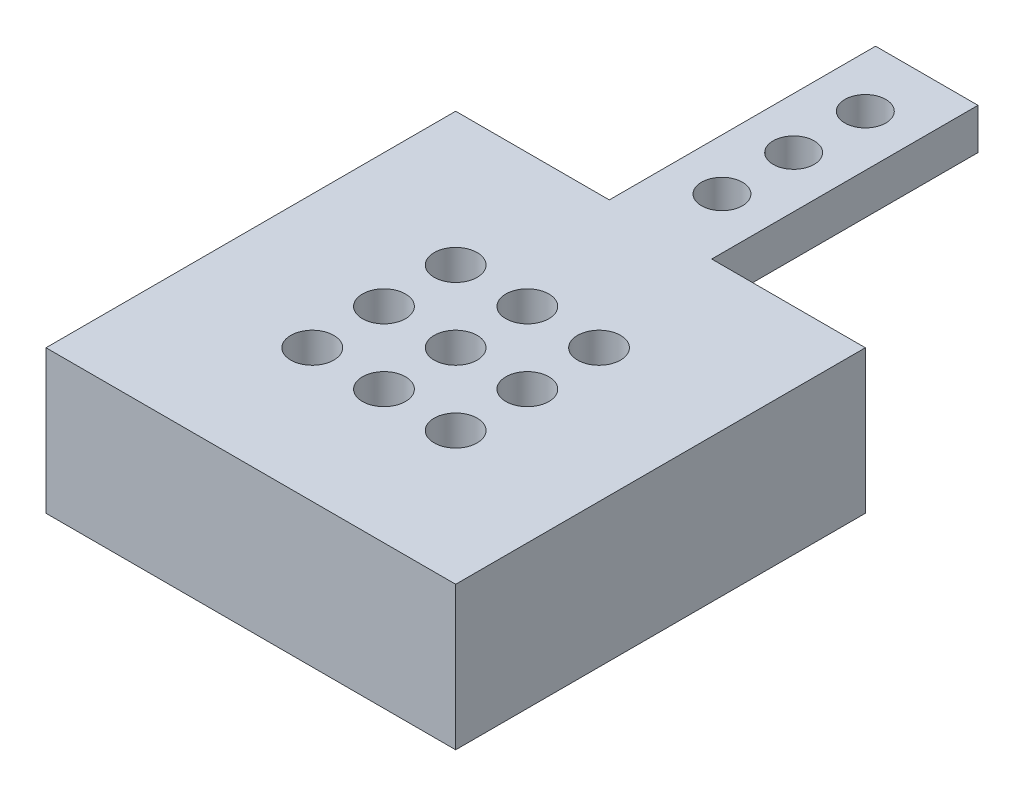
ISO-10303-21;
HEADER;
FILE_DESCRIPTION(('STEP AP214'),'2;1');
FILE_NAME('part.step','',(''),(''),'','','');
FILE_SCHEMA(('AUTOMOTIVE_DESIGN { 1 0 10303 214 1 1 1 1 }'));
ENDSEC;
DATA;
#1=APPLICATION_CONTEXT('core data for automotive mechanical design processes');
#2=APPLICATION_PROTOCOL_DEFINITION('international standard','automotive_design',2000,#1);
#3=PRODUCT_CONTEXT('',#1,'mechanical');
#4=PRODUCT('Part','Part','',(#3));
#5=PRODUCT_RELATED_PRODUCT_CATEGORY('part','',(#4));
#6=PRODUCT_DEFINITION_FORMATION('','',#4);
#7=PRODUCT_DEFINITION_CONTEXT('part definition',#1,'design');
#8=PRODUCT_DEFINITION('design','',#6,#7);
#9=PRODUCT_DEFINITION_SHAPE('','',#8);
#10=(LENGTH_UNIT() NAMED_UNIT(*) SI_UNIT(.MILLI.,.METRE.));
#11=(NAMED_UNIT(*) PLANE_ANGLE_UNIT() SI_UNIT($,.RADIAN.));
#12=(NAMED_UNIT(*) SI_UNIT($,.STERADIAN.) SOLID_ANGLE_UNIT());
#13=UNCERTAINTY_MEASURE_WITH_UNIT(LENGTH_MEASURE(1.E-05),#10,'distance_accuracy_value','');
#14=(GEOMETRIC_REPRESENTATION_CONTEXT(3) GLOBAL_UNCERTAINTY_ASSIGNED_CONTEXT((#13)) GLOBAL_UNIT_ASSIGNED_CONTEXT((#10,
#11,#12)) REPRESENTATION_CONTEXT('',''));
#15=CARTESIAN_POINT('',(0.,0.,0.));
#16=DIRECTION('',(0.,0.,1.));
#17=DIRECTION('',(1.,0.,0.));
#18=AXIS2_PLACEMENT_3D('',#15,#16,#17);
#19=CARTESIAN_POINT('',(0.,14.,-40.));
#20=DIRECTION('',(0.,0.,1.));
#21=DIRECTION('',(1.,0.,0.));
#22=AXIS2_PLACEMENT_3D('',#19,#20,#21);
#23=PLANE('',#22);
#24=DIRECTION('',(0.,1.,0.));
#25=VECTOR('',#24,1.);
#26=CARTESIAN_POINT('',(15.,14.,-40.));
#27=LINE('',#26,#25);
#28=CARTESIAN_POINT('',(15.,10.,-40.));
#29=VERTEX_POINT('',#28);
#30=CARTESIAN_POINT('',(15.,14.,-40.));
#31=VERTEX_POINT('',#30);
#32=EDGE_CURVE('E50',#29,#31,#27,.T.);
#33=ORIENTED_EDGE('',*,*,#32,.F.);
#34=DIRECTION('',(-1.,0.,0.));
#35=VECTOR('',#34,1.);
#36=CARTESIAN_POINT('',(15.,10.,-40.));
#37=LINE('',#36,#35);
#38=CARTESIAN_POINT('',(25.,10.,-40.));
#39=VERTEX_POINT('',#38);
#40=EDGE_CURVE('E119',#39,#29,#37,.T.);
#41=ORIENTED_EDGE('',*,*,#40,.F.);
#42=DIRECTION('',(0.,-1.,0.));
#43=VECTOR('',#42,1.);
#44=CARTESIAN_POINT('',(25.,14.,-40.));
#45=LINE('',#44,#43);
#46=CARTESIAN_POINT('',(25.,14.,-40.));
#47=VERTEX_POINT('',#46);
#48=EDGE_CURVE('E136',#47,#39,#45,.T.);
#49=ORIENTED_EDGE('',*,*,#48,.F.);
#50=DIRECTION('',(-1.,0.,0.));
#51=VECTOR('',#50,1.);
#52=CARTESIAN_POINT('',(0.,14.,-40.));
#53=LINE('',#52,#51);
#54=CARTESIAN_POINT('',(40.,14.,-40.));
#55=VERTEX_POINT('',#54);
#56=EDGE_CURVE('E160',#55,#47,#53,.T.);
#57=ORIENTED_EDGE('',*,*,#56,.F.);
#58=DIRECTION('',(0.,-1.,0.));
#59=VECTOR('',#58,1.);
#60=CARTESIAN_POINT('',(40.,14.,-40.));
#61=LINE('',#60,#59);
#62=CARTESIAN_POINT('',(40.,0.,-40.));
#63=VERTEX_POINT('',#62);
#64=EDGE_CURVE('E165',#55,#63,#61,.T.);
#65=ORIENTED_EDGE('',*,*,#64,.T.);
#66=DIRECTION('',(-1.,0.,0.));
#67=VECTOR('',#66,1.);
#68=CARTESIAN_POINT('',(0.,0.,-40.));
#69=LINE('',#68,#67);
#70=CARTESIAN_POINT('',(0.,0.,-40.));
#71=VERTEX_POINT('',#70);
#72=EDGE_CURVE('E150',#63,#71,#69,.T.);
#73=ORIENTED_EDGE('',*,*,#72,.T.);
#74=DIRECTION('',(0.,-1.,0.));
#75=VECTOR('',#74,1.);
#76=CARTESIAN_POINT('',(0.,14.,-40.));
#77=LINE('',#76,#75);
#78=CARTESIAN_POINT('',(0.,14.,-40.));
#79=VERTEX_POINT('',#78);
#80=EDGE_CURVE('E161',#79,#71,#77,.T.);
#81=ORIENTED_EDGE('',*,*,#80,.F.);
#82=EDGE_CURVE('E55',#31,#79,#53,.T.);
#83=ORIENTED_EDGE('',*,*,#82,.F.);
#84=EDGE_LOOP('',(#33,#41,#49,#57,#65,#73,#81,#83));
#85=FACE_BOUND('',#84,.T.);
#86=ADVANCED_FACE('F33',(#85),#23,.F.);
#87=CARTESIAN_POINT('',(0.,14.,0.));
#88=DIRECTION('',(1.,0.,0.));
#89=DIRECTION('',(0.,0.,-1.));
#90=AXIS2_PLACEMENT_3D('',#87,#88,#89);
#91=PLANE('',#90);
#92=DIRECTION('',(0.,0.,1.));
#93=VECTOR('',#92,1.);
#94=CARTESIAN_POINT('',(0.,0.,0.));
#95=LINE('',#94,#93);
#96=CARTESIAN_POINT('',(0.,0.,0.));
#97=VERTEX_POINT('',#96);
#98=EDGE_CURVE('E122',#71,#97,#95,.T.);
#99=ORIENTED_EDGE('',*,*,#98,.T.);
#100=DIRECTION('',(0.,-1.,0.));
#101=VECTOR('',#100,1.);
#102=CARTESIAN_POINT('',(0.,14.,0.));
#103=LINE('',#102,#101);
#104=CARTESIAN_POINT('',(0.,14.,0.));
#105=VERTEX_POINT('',#104);
#106=EDGE_CURVE('E11',#105,#97,#103,.T.);
#107=ORIENTED_EDGE('',*,*,#106,.F.);
#108=DIRECTION('',(0.,0.,1.));
#109=VECTOR('',#108,1.);
#110=CARTESIAN_POINT('',(0.,14.,0.));
#111=LINE('',#110,#109);
#112=EDGE_CURVE('E147',#79,#105,#111,.T.);
#113=ORIENTED_EDGE('',*,*,#112,.F.);
#114=ORIENTED_EDGE('',*,*,#80,.T.);
#115=EDGE_LOOP('',(#99,#107,#113,#114));
#116=FACE_BOUND('',#115,.T.);
#117=ADVANCED_FACE('F35',(#116),#91,.F.);
#118=CARTESIAN_POINT('',(0.,14.,0.));
#119=DIRECTION('',(0.,0.,-1.));
#120=DIRECTION('',(-1.,0.,0.));
#121=AXIS2_PLACEMENT_3D('',#118,#119,#120);
#122=PLANE('',#121);
#123=DIRECTION('',(1.,0.,0.));
#124=VECTOR('',#123,1.);
#125=CARTESIAN_POINT('',(0.,0.,0.));
#126=LINE('',#125,#124);
#127=CARTESIAN_POINT('',(40.,0.,0.));
#128=VERTEX_POINT('',#127);
#129=EDGE_CURVE('E125',#97,#128,#126,.T.);
#130=ORIENTED_EDGE('',*,*,#129,.T.);
#131=DIRECTION('',(0.,-1.,0.));
#132=VECTOR('',#131,1.);
#133=CARTESIAN_POINT('',(40.,14.,0.));
#134=LINE('',#133,#132);
#135=CARTESIAN_POINT('',(40.,14.,0.));
#136=VERTEX_POINT('',#135);
#137=EDGE_CURVE('E42',#136,#128,#134,.T.);
#138=ORIENTED_EDGE('',*,*,#137,.F.);
#139=DIRECTION('',(1.,0.,0.));
#140=VECTOR('',#139,1.);
#141=CARTESIAN_POINT('',(0.,14.,0.));
#142=LINE('',#141,#140);
#143=EDGE_CURVE('E149',#105,#136,#142,.T.);
#144=ORIENTED_EDGE('',*,*,#143,.F.);
#145=ORIENTED_EDGE('',*,*,#106,.T.);
#146=EDGE_LOOP('',(#130,#138,#144,#145));
#147=FACE_BOUND('',#146,.T.);
#148=ADVANCED_FACE('F174',(#147),#122,.F.);
#149=CARTESIAN_POINT('',(40.,14.,0.));
#150=DIRECTION('',(-1.,0.,0.));
#151=DIRECTION('',(0.,0.,1.));
#152=AXIS2_PLACEMENT_3D('',#149,#150,#151);
#153=PLANE('',#152);
#154=DIRECTION('',(0.,0.,-1.));
#155=VECTOR('',#154,1.);
#156=CARTESIAN_POINT('',(40.,0.,0.));
#157=LINE('',#156,#155);
#158=EDGE_CURVE('E171',#128,#63,#157,.T.);
#159=ORIENTED_EDGE('',*,*,#158,.T.);
#160=ORIENTED_EDGE('',*,*,#64,.F.);
#161=DIRECTION('',(0.,0.,-1.));
#162=VECTOR('',#161,1.);
#163=CARTESIAN_POINT('',(40.,14.,0.));
#164=LINE('',#163,#162);
#165=EDGE_CURVE('E152',#136,#55,#164,.T.);
#166=ORIENTED_EDGE('',*,*,#165,.F.);
#167=ORIENTED_EDGE('',*,*,#137,.T.);
#168=EDGE_LOOP('',(#159,#160,#166,#167));
#169=FACE_BOUND('',#168,.T.);
#170=ADVANCED_FACE('F181',(#169),#153,.F.);
#171=CARTESIAN_POINT('',(0.,14.,0.));
#172=DIRECTION('',(0.,-1.,0.));
#173=DIRECTION('',(0.,0.,-1.));
#174=AXIS2_PLACEMENT_3D('',#171,#172,#173);
#175=PLANE('',#174);
#176=CARTESIAN_POINT('',(13.,14.,-13.));
#177=DIRECTION('',(0.,-1.,0.));
#178=DIRECTION('',(0.,0.,-1.));
#179=AXIS2_PLACEMENT_3D('',#176,#177,#178);
#180=CIRCLE('',#179,2.1);
#181=CARTESIAN_POINT('',(13.,14.,-15.1));
#182=VERTEX_POINT('',#181);
#183=EDGE_CURVE('E255',#182,#182,#180,.T.);
#184=ORIENTED_EDGE('',*,*,#183,.T.);
#185=EDGE_LOOP('',(#184));
#186=FACE_BOUND('',#185,.T.);
#187=CARTESIAN_POINT('',(13.,14.,-20.));
#188=DIRECTION('',(0.,-1.,0.));
#189=DIRECTION('',(0.,0.,-1.));
#190=AXIS2_PLACEMENT_3D('',#187,#188,#189);
#191=CIRCLE('',#190,2.1);
#192=CARTESIAN_POINT('',(13.,14.,-22.1));
#193=VERTEX_POINT('',#192);
#194=EDGE_CURVE('E249',#193,#193,#191,.T.);
#195=ORIENTED_EDGE('',*,*,#194,.T.);
#196=EDGE_LOOP('',(#195));
#197=FACE_BOUND('',#196,.T.);
#198=CARTESIAN_POINT('',(27.,14.,-13.));
#199=DIRECTION('',(0.,-1.,0.));
#200=DIRECTION('',(0.,0.,-1.));
#201=AXIS2_PLACEMENT_3D('',#198,#199,#200);
#202=CIRCLE('',#201,2.1);
#203=CARTESIAN_POINT('',(27.,14.,-15.1));
#204=VERTEX_POINT('',#203);
#205=EDGE_CURVE('E243',#204,#204,#202,.T.);
#206=ORIENTED_EDGE('',*,*,#205,.T.);
#207=EDGE_LOOP('',(#206));
#208=FACE_BOUND('',#207,.T.);
#209=CARTESIAN_POINT('',(20.,14.,-13.));
#210=DIRECTION('',(0.,-1.,0.));
#211=DIRECTION('',(0.,0.,-1.));
#212=AXIS2_PLACEMENT_3D('',#209,#210,#211);
#213=CIRCLE('',#212,2.1);
#214=CARTESIAN_POINT('',(20.,14.,-15.1));
#215=VERTEX_POINT('',#214);
#216=EDGE_CURVE('E237',#215,#215,#213,.T.);
#217=ORIENTED_EDGE('',*,*,#216,.T.);
#218=EDGE_LOOP('',(#217));
#219=FACE_BOUND('',#218,.T.);
#220=CARTESIAN_POINT('',(27.,14.,-20.));
#221=DIRECTION('',(0.,-1.,0.));
#222=DIRECTION('',(0.,0.,-1.));
#223=AXIS2_PLACEMENT_3D('',#220,#221,#222);
#224=CIRCLE('',#223,2.1);
#225=CARTESIAN_POINT('',(27.,14.,-22.1));
#226=VERTEX_POINT('',#225);
#227=EDGE_CURVE('E231',#226,#226,#224,.T.);
#228=ORIENTED_EDGE('',*,*,#227,.T.);
#229=EDGE_LOOP('',(#228));
#230=FACE_BOUND('',#229,.T.);
#231=CARTESIAN_POINT('',(20.,14.,-20.));
#232=DIRECTION('',(0.,-1.,0.));
#233=DIRECTION('',(0.,0.,-1.));
#234=AXIS2_PLACEMENT_3D('',#231,#232,#233);
#235=CIRCLE('',#234,2.1);
#236=CARTESIAN_POINT('',(20.,14.,-22.1));
#237=VERTEX_POINT('',#236);
#238=EDGE_CURVE('E225',#237,#237,#235,.T.);
#239=ORIENTED_EDGE('',*,*,#238,.T.);
#240=EDGE_LOOP('',(#239));
#241=FACE_BOUND('',#240,.T.);
#242=CARTESIAN_POINT('',(27.,14.,-27.));
#243=DIRECTION('',(0.,-1.,0.));
#244=DIRECTION('',(0.,0.,-1.));
#245=AXIS2_PLACEMENT_3D('',#242,#243,#244);
#246=CIRCLE('',#245,2.1);
#247=CARTESIAN_POINT('',(27.,14.,-29.1));
#248=VERTEX_POINT('',#247);
#249=EDGE_CURVE('E219',#248,#248,#246,.T.);
#250=ORIENTED_EDGE('',*,*,#249,.T.);
#251=EDGE_LOOP('',(#250));
#252=FACE_BOUND('',#251,.T.);
#253=CARTESIAN_POINT('',(20.,14.,-27.));
#254=DIRECTION('',(0.,-1.,0.));
#255=DIRECTION('',(0.,0.,-1.));
#256=AXIS2_PLACEMENT_3D('',#253,#254,#255);
#257=CIRCLE('',#256,2.1);
#258=CARTESIAN_POINT('',(20.,14.,-29.1));
#259=VERTEX_POINT('',#258);
#260=EDGE_CURVE('E213',#259,#259,#257,.T.);
#261=ORIENTED_EDGE('',*,*,#260,.T.);
#262=EDGE_LOOP('',(#261));
#263=FACE_BOUND('',#262,.T.);
#264=CARTESIAN_POINT('',(13.,14.,-27.));
#265=DIRECTION('',(0.,-1.,0.));
#266=DIRECTION('',(0.,0.,-1.));
#267=AXIS2_PLACEMENT_3D('',#264,#265,#266);
#268=CIRCLE('',#267,2.1);
#269=CARTESIAN_POINT('',(13.,14.,-29.1));
#270=VERTEX_POINT('',#269);
#271=EDGE_CURVE('E207',#270,#270,#268,.T.);
#272=ORIENTED_EDGE('',*,*,#271,.T.);
#273=EDGE_LOOP('',(#272));
#274=FACE_BOUND('',#273,.T.);
#275=CARTESIAN_POINT('',(20.,14.,-46.));
#276=DIRECTION('',(0.,1.,0.));
#277=DIRECTION('',(0.,0.,1.));
#278=AXIS2_PLACEMENT_3D('',#275,#276,#277);
#279=CIRCLE('',#278,2.);
#280=CARTESIAN_POINT('',(20.,14.,-44.));
#281=VERTEX_POINT('',#280);
#282=EDGE_CURVE('E204',#281,#281,#279,.T.);
#283=ORIENTED_EDGE('',*,*,#282,.F.);
#284=EDGE_LOOP('',(#283));
#285=FACE_BOUND('',#284,.T.);
#286=CARTESIAN_POINT('',(20.,14.,-53.));
#287=DIRECTION('',(0.,1.,0.));
#288=DIRECTION('',(0.,0.,1.));
#289=AXIS2_PLACEMENT_3D('',#286,#287,#288);
#290=CIRCLE('',#289,2.);
#291=CARTESIAN_POINT('',(20.,14.,-51.));
#292=VERTEX_POINT('',#291);
#293=EDGE_CURVE('E201',#292,#292,#290,.T.);
#294=ORIENTED_EDGE('',*,*,#293,.F.);
#295=EDGE_LOOP('',(#294));
#296=FACE_BOUND('',#295,.T.);
#297=CARTESIAN_POINT('',(20.,14.,-60.));
#298=DIRECTION('',(0.,1.,0.));
#299=DIRECTION('',(0.,0.,1.));
#300=AXIS2_PLACEMENT_3D('',#297,#298,#299);
#301=CIRCLE('',#300,2.);
#302=CARTESIAN_POINT('',(20.,14.,-58.));
#303=VERTEX_POINT('',#302);
#304=EDGE_CURVE('E197',#303,#303,#301,.T.);
#305=ORIENTED_EDGE('',*,*,#304,.F.);
#306=EDGE_LOOP('',(#305));
#307=FACE_BOUND('',#306,.T.);
#308=ORIENTED_EDGE('',*,*,#112,.T.);
#309=ORIENTED_EDGE('',*,*,#143,.T.);
#310=ORIENTED_EDGE('',*,*,#165,.T.);
#311=ORIENTED_EDGE('',*,*,#56,.T.);
#312=DIRECTION('',(0.,0.,1.));
#313=VECTOR('',#312,1.);
#314=CARTESIAN_POINT('',(25.,14.,-66.));
#315=LINE('',#314,#313);
#316=CARTESIAN_POINT('',(25.,14.,-66.));
#317=VERTEX_POINT('',#316);
#318=EDGE_CURVE('E106',#317,#47,#315,.T.);
#319=ORIENTED_EDGE('',*,*,#318,.F.);
#320=DIRECTION('',(1.,0.,0.));
#321=VECTOR('',#320,1.);
#322=CARTESIAN_POINT('',(15.,14.,-66.));
#323=LINE('',#322,#321);
#324=CARTESIAN_POINT('',(15.,14.,-66.));
#325=VERTEX_POINT('',#324);
#326=EDGE_CURVE('E98',#325,#317,#323,.T.);
#327=ORIENTED_EDGE('',*,*,#326,.F.);
#328=DIRECTION('',(0.,0.,1.));
#329=VECTOR('',#328,1.);
#330=CARTESIAN_POINT('',(15.,14.,-66.));
#331=LINE('',#330,#329);
#332=EDGE_CURVE('E103',#325,#31,#331,.T.);
#333=ORIENTED_EDGE('',*,*,#332,.T.);
#334=ORIENTED_EDGE('',*,*,#82,.T.);
#335=EDGE_LOOP('',(#308,#309,#310,#311,#319,#327,#333,#334));
#336=FACE_BOUND('',#335,.T.);
#337=ADVANCED_FACE('F101',(#186,#197,#208,#219,#230,#241,#252,#263,#274,#285,#296,#307,#336),
#175,.F.);
#338=CARTESIAN_POINT('',(0.,0.,0.));
#339=DIRECTION('',(0.,-1.,0.));
#340=DIRECTION('',(0.,0.,-1.));
#341=AXIS2_PLACEMENT_3D('',#338,#339,#340);
#342=PLANE('',#341);
#343=CARTESIAN_POINT('',(13.,0.,-13.));
#344=DIRECTION('',(0.,-1.,0.));
#345=DIRECTION('',(0.,0.,-1.));
#346=AXIS2_PLACEMENT_3D('',#343,#344,#345);
#347=CIRCLE('',#346,2.1);
#348=CARTESIAN_POINT('',(13.,0.,-15.1));
#349=VERTEX_POINT('',#348);
#350=EDGE_CURVE('E258',#349,#349,#347,.T.);
#351=ORIENTED_EDGE('',*,*,#350,.F.);
#352=EDGE_LOOP('',(#351));
#353=FACE_BOUND('',#352,.T.);
#354=CARTESIAN_POINT('',(13.,0.,-20.));
#355=DIRECTION('',(0.,-1.,0.));
#356=DIRECTION('',(0.,0.,-1.));
#357=AXIS2_PLACEMENT_3D('',#354,#355,#356);
#358=CIRCLE('',#357,2.1);
#359=CARTESIAN_POINT('',(13.,0.,-22.1));
#360=VERTEX_POINT('',#359);
#361=EDGE_CURVE('E252',#360,#360,#358,.T.);
#362=ORIENTED_EDGE('',*,*,#361,.F.);
#363=EDGE_LOOP('',(#362));
#364=FACE_BOUND('',#363,.T.);
#365=CARTESIAN_POINT('',(27.,0.,-13.));
#366=DIRECTION('',(0.,-1.,0.));
#367=DIRECTION('',(0.,0.,-1.));
#368=AXIS2_PLACEMENT_3D('',#365,#366,#367);
#369=CIRCLE('',#368,2.1);
#370=CARTESIAN_POINT('',(27.,0.,-15.1));
#371=VERTEX_POINT('',#370);
#372=EDGE_CURVE('E246',#371,#371,#369,.T.);
#373=ORIENTED_EDGE('',*,*,#372,.F.);
#374=EDGE_LOOP('',(#373));
#375=FACE_BOUND('',#374,.T.);
#376=CARTESIAN_POINT('',(20.,0.,-13.));
#377=DIRECTION('',(0.,-1.,0.));
#378=DIRECTION('',(0.,0.,-1.));
#379=AXIS2_PLACEMENT_3D('',#376,#377,#378);
#380=CIRCLE('',#379,2.1);
#381=CARTESIAN_POINT('',(20.,0.,-15.1));
#382=VERTEX_POINT('',#381);
#383=EDGE_CURVE('E240',#382,#382,#380,.T.);
#384=ORIENTED_EDGE('',*,*,#383,.F.);
#385=EDGE_LOOP('',(#384));
#386=FACE_BOUND('',#385,.T.);
#387=CARTESIAN_POINT('',(27.,0.,-20.));
#388=DIRECTION('',(0.,-1.,0.));
#389=DIRECTION('',(0.,0.,-1.));
#390=AXIS2_PLACEMENT_3D('',#387,#388,#389);
#391=CIRCLE('',#390,2.1);
#392=CARTESIAN_POINT('',(27.,0.,-22.1));
#393=VERTEX_POINT('',#392);
#394=EDGE_CURVE('E234',#393,#393,#391,.T.);
#395=ORIENTED_EDGE('',*,*,#394,.F.);
#396=EDGE_LOOP('',(#395));
#397=FACE_BOUND('',#396,.T.);
#398=CARTESIAN_POINT('',(20.,0.,-20.));
#399=DIRECTION('',(0.,-1.,0.));
#400=DIRECTION('',(0.,0.,-1.));
#401=AXIS2_PLACEMENT_3D('',#398,#399,#400);
#402=CIRCLE('',#401,2.1);
#403=CARTESIAN_POINT('',(20.,0.,-22.1));
#404=VERTEX_POINT('',#403);
#405=EDGE_CURVE('E228',#404,#404,#402,.T.);
#406=ORIENTED_EDGE('',*,*,#405,.F.);
#407=EDGE_LOOP('',(#406));
#408=FACE_BOUND('',#407,.T.);
#409=CARTESIAN_POINT('',(27.,0.,-27.));
#410=DIRECTION('',(0.,-1.,0.));
#411=DIRECTION('',(0.,0.,-1.));
#412=AXIS2_PLACEMENT_3D('',#409,#410,#411);
#413=CIRCLE('',#412,2.1);
#414=CARTESIAN_POINT('',(27.,0.,-29.1));
#415=VERTEX_POINT('',#414);
#416=EDGE_CURVE('E222',#415,#415,#413,.T.);
#417=ORIENTED_EDGE('',*,*,#416,.F.);
#418=EDGE_LOOP('',(#417));
#419=FACE_BOUND('',#418,.T.);
#420=CARTESIAN_POINT('',(20.,0.,-27.));
#421=DIRECTION('',(0.,-1.,0.));
#422=DIRECTION('',(0.,0.,-1.));
#423=AXIS2_PLACEMENT_3D('',#420,#421,#422);
#424=CIRCLE('',#423,2.1);
#425=CARTESIAN_POINT('',(20.,0.,-29.1));
#426=VERTEX_POINT('',#425);
#427=EDGE_CURVE('E216',#426,#426,#424,.T.);
#428=ORIENTED_EDGE('',*,*,#427,.F.);
#429=EDGE_LOOP('',(#428));
#430=FACE_BOUND('',#429,.T.);
#431=CARTESIAN_POINT('',(13.,0.,-27.));
#432=DIRECTION('',(0.,-1.,0.));
#433=DIRECTION('',(0.,0.,-1.));
#434=AXIS2_PLACEMENT_3D('',#431,#432,#433);
#435=CIRCLE('',#434,2.1);
#436=CARTESIAN_POINT('',(13.,0.,-29.1));
#437=VERTEX_POINT('',#436);
#438=EDGE_CURVE('E210',#437,#437,#435,.T.);
#439=ORIENTED_EDGE('',*,*,#438,.F.);
#440=EDGE_LOOP('',(#439));
#441=FACE_BOUND('',#440,.T.);
#442=ORIENTED_EDGE('',*,*,#98,.F.);
#443=ORIENTED_EDGE('',*,*,#72,.F.);
#444=ORIENTED_EDGE('',*,*,#158,.F.);
#445=ORIENTED_EDGE('',*,*,#129,.F.);
#446=EDGE_LOOP('',(#442,#443,#444,#445));
#447=FACE_BOUND('',#446,.T.);
#448=ADVANCED_FACE('F184',(#353,#364,#375,#386,#397,#408,#419,#430,#441,#447),#342,.T.);
#449=CARTESIAN_POINT('',(15.,14.,-66.));
#450=DIRECTION('',(1.,0.,0.));
#451=DIRECTION('',(0.,1.,0.));
#452=AXIS2_PLACEMENT_3D('',#449,#450,#451);
#453=PLANE('',#452);
#454=ORIENTED_EDGE('',*,*,#32,.T.);
#455=ORIENTED_EDGE('',*,*,#332,.F.);
#456=DIRECTION('',(0.,1.,0.));
#457=VECTOR('',#456,1.);
#458=CARTESIAN_POINT('',(15.,14.,-66.));
#459=LINE('',#458,#457);
#460=CARTESIAN_POINT('',(15.,10.,-66.));
#461=VERTEX_POINT('',#460);
#462=EDGE_CURVE('E110',#461,#325,#459,.T.);
#463=ORIENTED_EDGE('',*,*,#462,.F.);
#464=DIRECTION('',(0.,0.,1.));
#465=VECTOR('',#464,1.);
#466=CARTESIAN_POINT('',(15.,10.,-66.));
#467=LINE('',#466,#465);
#468=EDGE_CURVE('E143',#461,#29,#467,.T.);
#469=ORIENTED_EDGE('',*,*,#468,.T.);
#470=EDGE_LOOP('',(#454,#455,#463,#469));
#471=FACE_BOUND('',#470,.T.);
#472=ADVANCED_FACE('F121',(#471),#453,.F.);
#473=CARTESIAN_POINT('',(25.,14.,-66.));
#474=DIRECTION('',(-1.,0.,0.));
#475=DIRECTION('',(0.,0.,1.));
#476=AXIS2_PLACEMENT_3D('',#473,#474,#475);
#477=PLANE('',#476);
#478=ORIENTED_EDGE('',*,*,#48,.T.);
#479=DIRECTION('',(0.,0.,1.));
#480=VECTOR('',#479,1.);
#481=CARTESIAN_POINT('',(25.,10.,-66.));
#482=LINE('',#481,#480);
#483=CARTESIAN_POINT('',(25.,10.,-66.));
#484=VERTEX_POINT('',#483);
#485=EDGE_CURVE('E127',#484,#39,#482,.T.);
#486=ORIENTED_EDGE('',*,*,#485,.F.);
#487=DIRECTION('',(0.,-1.,0.));
#488=VECTOR('',#487,1.);
#489=CARTESIAN_POINT('',(25.,14.,-66.));
#490=LINE('',#489,#488);
#491=EDGE_CURVE('E109',#317,#484,#490,.T.);
#492=ORIENTED_EDGE('',*,*,#491,.F.);
#493=ORIENTED_EDGE('',*,*,#318,.T.);
#494=EDGE_LOOP('',(#478,#486,#492,#493));
#495=FACE_BOUND('',#494,.T.);
#496=ADVANCED_FACE('F193',(#495),#477,.F.);
#497=CARTESIAN_POINT('',(15.,10.,-66.));
#498=DIRECTION('',(0.,1.,0.));
#499=DIRECTION('',(0.,0.,1.));
#500=AXIS2_PLACEMENT_3D('',#497,#498,#499);
#501=PLANE('',#500);
#502=CARTESIAN_POINT('',(20.,10.,-46.));
#503=DIRECTION('',(0.,1.,0.));
#504=DIRECTION('',(0.,0.,1.));
#505=AXIS2_PLACEMENT_3D('',#502,#503,#504);
#506=CIRCLE('',#505,2.);
#507=CARTESIAN_POINT('',(20.,10.,-44.));
#508=VERTEX_POINT('',#507);
#509=EDGE_CURVE('E37',#508,#508,#506,.T.);
#510=ORIENTED_EDGE('',*,*,#509,.T.);
#511=EDGE_LOOP('',(#510));
#512=FACE_BOUND('',#511,.T.);
#513=CARTESIAN_POINT('',(20.,10.,-53.));
#514=DIRECTION('',(0.,1.,0.));
#515=DIRECTION('',(0.,0.,1.));
#516=AXIS2_PLACEMENT_3D('',#513,#514,#515);
#517=CIRCLE('',#516,2.);
#518=CARTESIAN_POINT('',(20.,10.,-51.));
#519=VERTEX_POINT('',#518);
#520=EDGE_CURVE('E200',#519,#519,#517,.T.);
#521=ORIENTED_EDGE('',*,*,#520,.T.);
#522=EDGE_LOOP('',(#521));
#523=FACE_BOUND('',#522,.T.);
#524=CARTESIAN_POINT('',(20.,10.,-60.));
#525=DIRECTION('',(0.,1.,0.));
#526=DIRECTION('',(0.,0.,1.));
#527=AXIS2_PLACEMENT_3D('',#524,#525,#526);
#528=CIRCLE('',#527,2.);
#529=CARTESIAN_POINT('',(20.,10.,-58.));
#530=VERTEX_POINT('',#529);
#531=EDGE_CURVE('E137',#530,#530,#528,.T.);
#532=ORIENTED_EDGE('',*,*,#531,.T.);
#533=EDGE_LOOP('',(#532));
#534=FACE_BOUND('',#533,.T.);
#535=ORIENTED_EDGE('',*,*,#40,.T.);
#536=ORIENTED_EDGE('',*,*,#468,.F.);
#537=DIRECTION('',(-1.,0.,0.));
#538=VECTOR('',#537,1.);
#539=CARTESIAN_POINT('',(15.,10.,-66.));
#540=LINE('',#539,#538);
#541=EDGE_CURVE('E115',#484,#461,#540,.T.);
#542=ORIENTED_EDGE('',*,*,#541,.F.);
#543=ORIENTED_EDGE('',*,*,#485,.T.);
#544=EDGE_LOOP('',(#535,#536,#542,#543));
#545=FACE_BOUND('',#544,.T.);
#546=ADVANCED_FACE('F195',(#512,#523,#534,#545),#501,.F.);
#547=CARTESIAN_POINT('',(0.,0.,-66.));
#548=DIRECTION('',(0.,0.,1.));
#549=DIRECTION('',(1.,0.,0.));
#550=AXIS2_PLACEMENT_3D('',#547,#548,#549);
#551=PLANE('',#550);
#552=ORIENTED_EDGE('',*,*,#462,.T.);
#553=ORIENTED_EDGE('',*,*,#326,.T.);
#554=ORIENTED_EDGE('',*,*,#491,.T.);
#555=ORIENTED_EDGE('',*,*,#541,.T.);
#556=EDGE_LOOP('',(#552,#553,#554,#555));
#557=FACE_BOUND('',#556,.T.);
#558=ADVANCED_FACE('F113',(#557),#551,.F.);
#559=CARTESIAN_POINT('',(20.,-12.,-60.));
#560=DIRECTION('',(0.,1.,0.));
#561=DIRECTION('',(0.,0.,1.));
#562=AXIS2_PLACEMENT_3D('',#559,#560,#561);
#563=CYLINDRICAL_SURFACE('',#562,2.);
#564=ORIENTED_EDGE('',*,*,#304,.T.);
#565=EDGE_LOOP('',(#564));
#566=FACE_BOUND('',#565,.T.);
#567=ORIENTED_EDGE('',*,*,#531,.F.);
#568=EDGE_LOOP('',(#567));
#569=FACE_BOUND('',#568,.T.);
#570=ADVANCED_FACE('F302',(#566,#569),#563,.F.);
#571=CARTESIAN_POINT('',(20.,-12.,-53.));
#572=DIRECTION('',(0.,1.,0.));
#573=DIRECTION('',(0.,0.,1.));
#574=AXIS2_PLACEMENT_3D('',#571,#572,#573);
#575=CYLINDRICAL_SURFACE('',#574,2.);
#576=ORIENTED_EDGE('',*,*,#293,.T.);
#577=EDGE_LOOP('',(#576));
#578=FACE_BOUND('',#577,.T.);
#579=ORIENTED_EDGE('',*,*,#520,.F.);
#580=EDGE_LOOP('',(#579));
#581=FACE_BOUND('',#580,.T.);
#582=ADVANCED_FACE('F305',(#578,#581),#575,.F.);
#583=CARTESIAN_POINT('',(20.,-12.,-46.));
#584=DIRECTION('',(0.,1.,0.));
#585=DIRECTION('',(0.,0.,1.));
#586=AXIS2_PLACEMENT_3D('',#583,#584,#585);
#587=CYLINDRICAL_SURFACE('',#586,2.);
#588=ORIENTED_EDGE('',*,*,#282,.T.);
#589=EDGE_LOOP('',(#588));
#590=FACE_BOUND('',#589,.T.);
#591=ORIENTED_EDGE('',*,*,#509,.F.);
#592=EDGE_LOOP('',(#591));
#593=FACE_BOUND('',#592,.T.);
#594=ADVANCED_FACE('F288',(#590,#593),#587,.F.);
#595=CARTESIAN_POINT('',(13.,14.00005,-27.));
#596=DIRECTION('',(0.,-1.,0.));
#597=DIRECTION('',(0.,0.,-1.));
#598=AXIS2_PLACEMENT_3D('',#595,#596,#597);
#599=CYLINDRICAL_SURFACE('',#598,2.1);
#600=ORIENTED_EDGE('',*,*,#438,.T.);
#601=EDGE_LOOP('',(#600));
#602=FACE_BOUND('',#601,.T.);
#603=ORIENTED_EDGE('',*,*,#271,.F.);
#604=EDGE_LOOP('',(#603));
#605=FACE_BOUND('',#604,.T.);
#606=ADVANCED_FACE('F284',(#602,#605),#599,.F.);
#607=CARTESIAN_POINT('',(20.,14.00005,-27.));
#608=DIRECTION('',(0.,-1.,0.));
#609=DIRECTION('',(0.,0.,-1.));
#610=AXIS2_PLACEMENT_3D('',#607,#608,#609);
#611=CYLINDRICAL_SURFACE('',#610,2.1);
#612=ORIENTED_EDGE('',*,*,#427,.T.);
#613=EDGE_LOOP('',(#612));
#614=FACE_BOUND('',#613,.T.);
#615=ORIENTED_EDGE('',*,*,#260,.F.);
#616=EDGE_LOOP('',(#615));
#617=FACE_BOUND('',#616,.T.);
#618=ADVANCED_FACE('F287',(#614,#617),#611,.F.);
#619=CARTESIAN_POINT('',(27.,14.00005,-27.));
#620=DIRECTION('',(0.,-1.,0.));
#621=DIRECTION('',(0.,0.,-1.));
#622=AXIS2_PLACEMENT_3D('',#619,#620,#621);
#623=CYLINDRICAL_SURFACE('',#622,2.1);
#624=ORIENTED_EDGE('',*,*,#416,.T.);
#625=EDGE_LOOP('',(#624));
#626=FACE_BOUND('',#625,.T.);
#627=ORIENTED_EDGE('',*,*,#249,.F.);
#628=EDGE_LOOP('',(#627));
#629=FACE_BOUND('',#628,.T.);
#630=ADVANCED_FACE('F407',(#626,#629),#623,.F.);
#631=CARTESIAN_POINT('',(20.,14.00005,-20.));
#632=DIRECTION('',(0.,-1.,0.));
#633=DIRECTION('',(0.,0.,-1.));
#634=AXIS2_PLACEMENT_3D('',#631,#632,#633);
#635=CYLINDRICAL_SURFACE('',#634,2.1);
#636=ORIENTED_EDGE('',*,*,#405,.T.);
#637=EDGE_LOOP('',(#636));
#638=FACE_BOUND('',#637,.T.);
#639=ORIENTED_EDGE('',*,*,#238,.F.);
#640=EDGE_LOOP('',(#639));
#641=FACE_BOUND('',#640,.T.);
#642=ADVANCED_FACE('F415',(#638,#641),#635,.F.);
#643=CARTESIAN_POINT('',(27.,14.00005,-20.));
#644=DIRECTION('',(0.,-1.,0.));
#645=DIRECTION('',(0.,0.,-1.));
#646=AXIS2_PLACEMENT_3D('',#643,#644,#645);
#647=CYLINDRICAL_SURFACE('',#646,2.1);
#648=ORIENTED_EDGE('',*,*,#394,.T.);
#649=EDGE_LOOP('',(#648));
#650=FACE_BOUND('',#649,.T.);
#651=ORIENTED_EDGE('',*,*,#227,.F.);
#652=EDGE_LOOP('',(#651));
#653=FACE_BOUND('',#652,.T.);
#654=ADVANCED_FACE('F423',(#650,#653),#647,.F.);
#655=CARTESIAN_POINT('',(20.,14.00005,-13.));
#656=DIRECTION('',(0.,-1.,0.));
#657=DIRECTION('',(0.,0.,-1.));
#658=AXIS2_PLACEMENT_3D('',#655,#656,#657);
#659=CYLINDRICAL_SURFACE('',#658,2.1);
#660=ORIENTED_EDGE('',*,*,#383,.T.);
#661=EDGE_LOOP('',(#660));
#662=FACE_BOUND('',#661,.T.);
#663=ORIENTED_EDGE('',*,*,#216,.F.);
#664=EDGE_LOOP('',(#663));
#665=FACE_BOUND('',#664,.T.);
#666=ADVANCED_FACE('F431',(#662,#665),#659,.F.);
#667=CARTESIAN_POINT('',(27.,14.00005,-13.));
#668=DIRECTION('',(0.,-1.,0.));
#669=DIRECTION('',(0.,0.,-1.));
#670=AXIS2_PLACEMENT_3D('',#667,#668,#669);
#671=CYLINDRICAL_SURFACE('',#670,2.1);
#672=ORIENTED_EDGE('',*,*,#372,.T.);
#673=EDGE_LOOP('',(#672));
#674=FACE_BOUND('',#673,.T.);
#675=ORIENTED_EDGE('',*,*,#205,.F.);
#676=EDGE_LOOP('',(#675));
#677=FACE_BOUND('',#676,.T.);
#678=ADVANCED_FACE('F439',(#674,#677),#671,.F.);
#679=CARTESIAN_POINT('',(13.,14.00005,-20.));
#680=DIRECTION('',(0.,-1.,0.));
#681=DIRECTION('',(0.,0.,-1.));
#682=AXIS2_PLACEMENT_3D('',#679,#680,#681);
#683=CYLINDRICAL_SURFACE('',#682,2.1);
#684=ORIENTED_EDGE('',*,*,#361,.T.);
#685=EDGE_LOOP('',(#684));
#686=FACE_BOUND('',#685,.T.);
#687=ORIENTED_EDGE('',*,*,#194,.F.);
#688=EDGE_LOOP('',(#687));
#689=FACE_BOUND('',#688,.T.);
#690=ADVANCED_FACE('F447',(#686,#689),#683,.F.);
#691=CARTESIAN_POINT('',(13.,14.00005,-13.));
#692=DIRECTION('',(0.,-1.,0.));
#693=DIRECTION('',(0.,0.,-1.));
#694=AXIS2_PLACEMENT_3D('',#691,#692,#693);
#695=CYLINDRICAL_SURFACE('',#694,2.1);
#696=ORIENTED_EDGE('',*,*,#350,.T.);
#697=EDGE_LOOP('',(#696));
#698=FACE_BOUND('',#697,.T.);
#699=ORIENTED_EDGE('',*,*,#183,.F.);
#700=EDGE_LOOP('',(#699));
#701=FACE_BOUND('',#700,.T.);
#702=ADVANCED_FACE('F262',(#698,#701),#695,.F.);
#703=CLOSED_SHELL('',(#86,#117,#148,#170,#337,#448,#472,#496,#546,#558,#570,#582,#594,#606,#618,
#630,#642,#654,#666,#678,#690,#702));
#704=MANIFOLD_SOLID_BREP('B2',#703);
#705=ADVANCED_BREP_SHAPE_REPRESENTATION('',(#18,#704),#14);
#706=SHAPE_DEFINITION_REPRESENTATION(#9,#705);
ENDSEC;
END-ISO-10303-21;
